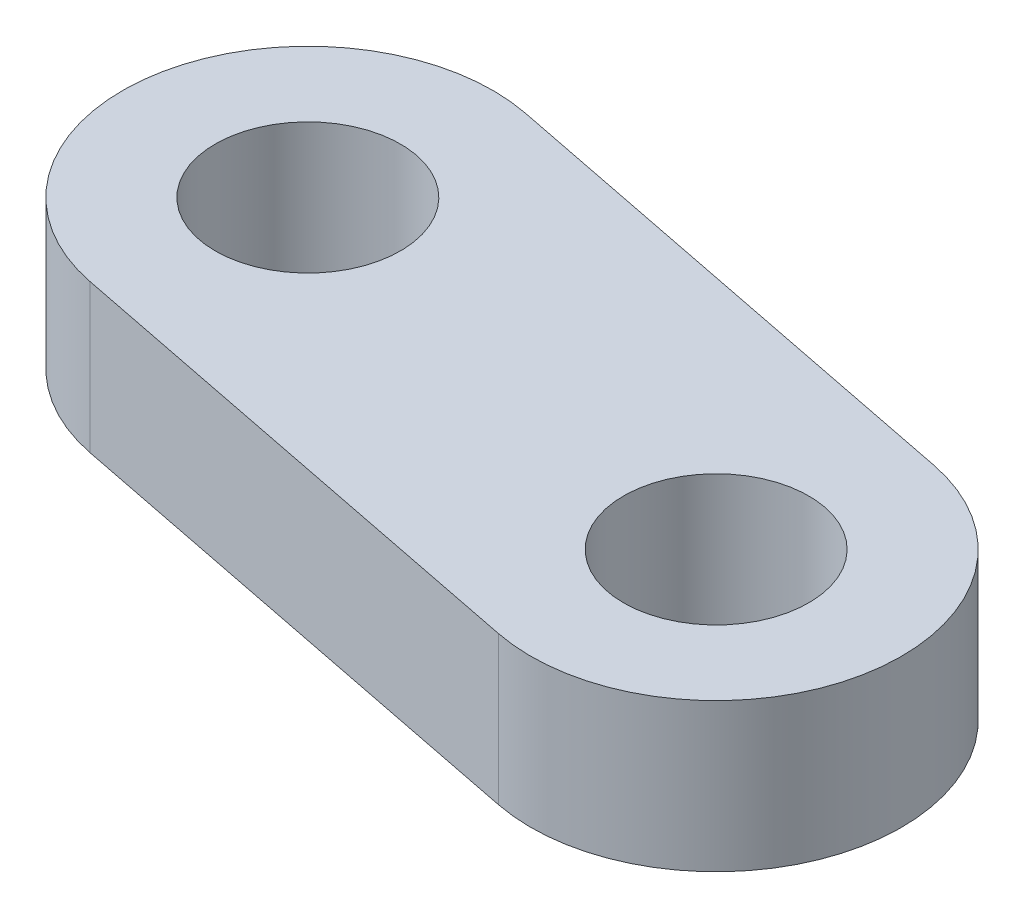
ISO-10303-21;
HEADER;
FILE_DESCRIPTION(('STEP AP214'),'2;1');
FILE_NAME('part.step','',(''),(''),'','','');
FILE_SCHEMA(('AUTOMOTIVE_DESIGN { 1 0 10303 214 1 1 1 1 }'));
ENDSEC;
DATA;
#1=APPLICATION_CONTEXT('core data for automotive mechanical design processes');
#2=APPLICATION_PROTOCOL_DEFINITION('international standard','automotive_design',2000,#1);
#3=PRODUCT_CONTEXT('',#1,'mechanical');
#4=PRODUCT('Part','Part','',(#3));
#5=PRODUCT_RELATED_PRODUCT_CATEGORY('part','',(#4));
#6=PRODUCT_DEFINITION_FORMATION('','',#4);
#7=PRODUCT_DEFINITION_CONTEXT('part definition',#1,'design');
#8=PRODUCT_DEFINITION('design','',#6,#7);
#9=PRODUCT_DEFINITION_SHAPE('','',#8);
#10=(LENGTH_UNIT() NAMED_UNIT(*) SI_UNIT(.MILLI.,.METRE.));
#11=(NAMED_UNIT(*) PLANE_ANGLE_UNIT() SI_UNIT($,.RADIAN.));
#12=(NAMED_UNIT(*) SI_UNIT($,.STERADIAN.) SOLID_ANGLE_UNIT());
#13=UNCERTAINTY_MEASURE_WITH_UNIT(LENGTH_MEASURE(1.E-05),#10,'distance_accuracy_value','');
#14=(GEOMETRIC_REPRESENTATION_CONTEXT(3) GLOBAL_UNCERTAINTY_ASSIGNED_CONTEXT((#13)) GLOBAL_UNIT_ASSIGNED_CONTEXT((#10,
#11,#12)) REPRESENTATION_CONTEXT('',''));
#15=CARTESIAN_POINT('',(0.,0.,0.));
#16=DIRECTION('',(0.,0.,1.));
#17=DIRECTION('',(1.,0.,0.));
#18=AXIS2_PLACEMENT_3D('',#15,#16,#17);
#19=CARTESIAN_POINT('',(0.,20.,0.));
#20=DIRECTION('',(0.,1.,0.));
#21=DIRECTION('',(0.,0.,1.));
#22=AXIS2_PLACEMENT_3D('',#19,#20,#21);
#23=PLANE('',#22);
#24=CARTESIAN_POINT('',(0.,20.,0.));
#25=DIRECTION('',(0.,1.,0.));
#26=DIRECTION('',(0.,0.,1.));
#27=AXIS2_PLACEMENT_3D('',#24,#25,#26);
#28=CIRCLE('',#27,12.5);
#29=CARTESIAN_POINT('',(0.,20.,12.5));
#30=VERTEX_POINT('',#29);
#31=EDGE_CURVE('E100',#30,#30,#28,.T.);
#32=ORIENTED_EDGE('',*,*,#31,.F.);
#33=EDGE_LOOP('',(#32));
#34=FACE_BOUND('',#33,.T.);
#35=CARTESIAN_POINT('',(0.,20.,0.));
#36=DIRECTION('',(0.,1.,0.));
#37=DIRECTION('',(0.,0.,1.));
#38=AXIS2_PLACEMENT_3D('',#35,#36,#37);
#39=CIRCLE('',#38,25.);
#40=CARTESIAN_POINT('',(4.84830465384728,20.,-24.5253734320903));
#41=VERTEX_POINT('',#40);
#42=CARTESIAN_POINT('',(-4.84830465384728,20.,24.5253734320903));
#43=VERTEX_POINT('',#42);
#44=EDGE_CURVE('E85',#41,#43,#39,.T.);
#45=ORIENTED_EDGE('',*,*,#44,.T.);
#46=DIRECTION('',(0.981014937283614,0.,0.193932186153892));
#47=VECTOR('',#46,1.);
#48=CARTESIAN_POINT('',(-4.84830465384728,20.,24.5253734320903));
#49=LINE('',#48,#47);
#50=CARTESIAN_POINT('',(63.8227409560057,20.,38.1006264628627));
#51=VERTEX_POINT('',#50);
#52=EDGE_CURVE('E80',#43,#51,#49,.T.);
#53=ORIENTED_EDGE('',*,*,#52,.T.);
#54=CARTESIAN_POINT('',(68.671045609853,20.,13.5752530307724));
#55=DIRECTION('',(0.,1.,0.));
#56=DIRECTION('',(0.,0.,1.));
#57=AXIS2_PLACEMENT_3D('',#54,#55,#56);
#58=CIRCLE('',#57,25.);
#59=CARTESIAN_POINT('',(73.5193502637002,20.,-10.9501204013179));
#60=VERTEX_POINT('',#59);
#61=EDGE_CURVE('E83',#51,#60,#58,.T.);
#62=ORIENTED_EDGE('',*,*,#61,.T.);
#63=DIRECTION('',(-0.981014937283614,0.,-0.193932186153891));
#64=VECTOR('',#63,1.);
#65=CARTESIAN_POINT('',(4.84830465384728,20.,-24.5253734320903));
#66=LINE('',#65,#64);
#67=EDGE_CURVE('E50',#60,#41,#66,.T.);
#68=ORIENTED_EDGE('',*,*,#67,.T.);
#69=EDGE_LOOP('',(#45,#53,#62,#68));
#70=FACE_BOUND('',#69,.T.);
#71=CARTESIAN_POINT('',(68.671045609853,20.,13.5752530307724));
#72=DIRECTION('',(0.,1.,0.));
#73=DIRECTION('',(0.,0.,1.));
#74=AXIS2_PLACEMENT_3D('',#71,#72,#73);
#75=CIRCLE('',#74,12.5);
#76=CARTESIAN_POINT('',(68.671045609853,20.,26.0752530307724));
#77=VERTEX_POINT('',#76);
#78=EDGE_CURVE('E115',#77,#77,#75,.T.);
#79=ORIENTED_EDGE('',*,*,#78,.F.);
#80=EDGE_LOOP('',(#79));
#81=FACE_BOUND('',#80,.T.);
#82=ADVANCED_FACE('F33',(#34,#70,#81),#23,.T.);
#83=CARTESIAN_POINT('',(0.,0.,0.));
#84=DIRECTION('',(0.,1.,0.));
#85=DIRECTION('',(0.,0.,1.));
#86=AXIS2_PLACEMENT_3D('',#83,#84,#85);
#87=PLANE('',#86);
#88=CARTESIAN_POINT('',(0.,0.,0.));
#89=DIRECTION('',(0.,1.,0.));
#90=DIRECTION('',(0.,0.,1.));
#91=AXIS2_PLACEMENT_3D('',#88,#89,#90);
#92=CIRCLE('',#91,25.);
#93=CARTESIAN_POINT('',(4.84830465384728,0.,-24.5253734320903));
#94=VERTEX_POINT('',#93);
#95=CARTESIAN_POINT('',(-4.84830465384728,0.,24.5253734320903));
#96=VERTEX_POINT('',#95);
#97=EDGE_CURVE('E97',#94,#96,#92,.T.);
#98=ORIENTED_EDGE('',*,*,#97,.F.);
#99=DIRECTION('',(-0.981014937283614,0.,-0.193932186153891));
#100=VECTOR('',#99,1.);
#101=CARTESIAN_POINT('',(4.84830465384728,0.,-24.5253734320903));
#102=LINE('',#101,#100);
#103=CARTESIAN_POINT('',(73.5193502637002,0.,-10.9501204013179));
#104=VERTEX_POINT('',#103);
#105=EDGE_CURVE('E73',#104,#94,#102,.T.);
#106=ORIENTED_EDGE('',*,*,#105,.F.);
#107=CARTESIAN_POINT('',(68.671045609853,0.,13.5752530307724));
#108=DIRECTION('',(0.,1.,0.));
#109=DIRECTION('',(0.,0.,1.));
#110=AXIS2_PLACEMENT_3D('',#107,#108,#109);
#111=CIRCLE('',#110,25.);
#112=CARTESIAN_POINT('',(63.8227409560057,0.,38.1006264628627));
#113=VERTEX_POINT('',#112);
#114=EDGE_CURVE('E67',#113,#104,#111,.T.);
#115=ORIENTED_EDGE('',*,*,#114,.F.);
#116=DIRECTION('',(0.981014937283614,0.,0.193932186153892));
#117=VECTOR('',#116,1.);
#118=CARTESIAN_POINT('',(-4.84830465384728,0.,24.5253734320903));
#119=LINE('',#118,#117);
#120=EDGE_CURVE('E89',#96,#113,#119,.T.);
#121=ORIENTED_EDGE('',*,*,#120,.F.);
#122=EDGE_LOOP('',(#98,#106,#115,#121));
#123=FACE_BOUND('',#122,.T.);
#124=CARTESIAN_POINT('',(0.,0.,0.));
#125=DIRECTION('',(0.,1.,0.));
#126=DIRECTION('',(0.,0.,1.));
#127=AXIS2_PLACEMENT_3D('',#124,#125,#126);
#128=CIRCLE('',#127,12.5);
#129=CARTESIAN_POINT('',(0.,0.,12.5));
#130=VERTEX_POINT('',#129);
#131=EDGE_CURVE('E112',#130,#130,#128,.T.);
#132=ORIENTED_EDGE('',*,*,#131,.T.);
#133=EDGE_LOOP('',(#132));
#134=FACE_BOUND('',#133,.T.);
#135=CARTESIAN_POINT('',(68.671045609853,0.,13.5752530307724));
#136=DIRECTION('',(0.,1.,0.));
#137=DIRECTION('',(0.,0.,1.));
#138=AXIS2_PLACEMENT_3D('',#135,#136,#137);
#139=CIRCLE('',#138,12.5);
#140=CARTESIAN_POINT('',(68.671045609853,0.,26.0752530307724));
#141=VERTEX_POINT('',#140);
#142=EDGE_CURVE('E118',#141,#141,#139,.T.);
#143=ORIENTED_EDGE('',*,*,#142,.T.);
#144=EDGE_LOOP('',(#143));
#145=FACE_BOUND('',#144,.T.);
#146=ADVANCED_FACE('F108',(#123,#134,#145),#87,.F.);
#147=CARTESIAN_POINT('',(0.,20.,0.));
#148=DIRECTION('',(0.,-1.,0.));
#149=DIRECTION('',(0.,0.,-1.));
#150=AXIS2_PLACEMENT_3D('',#147,#148,#149);
#151=CYLINDRICAL_SURFACE('',#150,25.);
#152=ORIENTED_EDGE('',*,*,#97,.T.);
#153=DIRECTION('',(0.,-1.,0.));
#154=VECTOR('',#153,1.);
#155=CARTESIAN_POINT('',(-4.84830465384728,20.,24.5253734320903));
#156=LINE('',#155,#154);
#157=EDGE_CURVE('E11',#43,#96,#156,.T.);
#158=ORIENTED_EDGE('',*,*,#157,.F.);
#159=ORIENTED_EDGE('',*,*,#44,.F.);
#160=DIRECTION('',(0.,-1.,0.));
#161=VECTOR('',#160,1.);
#162=CARTESIAN_POINT('',(4.84830465384728,20.,-24.5253734320903));
#163=LINE('',#162,#161);
#164=EDGE_CURVE('E93',#41,#94,#163,.T.);
#165=ORIENTED_EDGE('',*,*,#164,.T.);
#166=EDGE_LOOP('',(#152,#158,#159,#165));
#167=FACE_BOUND('',#166,.T.);
#168=ADVANCED_FACE('F35',(#167),#151,.T.);
#169=CARTESIAN_POINT('',(-4.84830465384728,20.,24.5253734320903));
#170=DIRECTION('',(0.193932186153892,0.,-0.981014937283614));
#171=DIRECTION('',(-0.981014937283614,0.,-0.193932186153892));
#172=AXIS2_PLACEMENT_3D('',#169,#170,#171);
#173=PLANE('',#172);
#174=ORIENTED_EDGE('',*,*,#120,.T.);
#175=DIRECTION('',(0.,-1.,0.));
#176=VECTOR('',#175,1.);
#177=CARTESIAN_POINT('',(63.8227409560057,20.,38.1006264628627));
#178=LINE('',#177,#176);
#179=EDGE_CURVE('E42',#51,#113,#178,.T.);
#180=ORIENTED_EDGE('',*,*,#179,.F.);
#181=ORIENTED_EDGE('',*,*,#52,.F.);
#182=ORIENTED_EDGE('',*,*,#157,.T.);
#183=EDGE_LOOP('',(#174,#180,#181,#182));
#184=FACE_BOUND('',#183,.T.);
#185=ADVANCED_FACE('F88',(#184),#173,.F.);
#186=CARTESIAN_POINT('',(68.671045609853,20.,13.5752530307724));
#187=DIRECTION('',(0.,-1.,0.));
#188=DIRECTION('',(0.,0.,-1.));
#189=AXIS2_PLACEMENT_3D('',#186,#187,#188);
#190=CYLINDRICAL_SURFACE('',#189,25.);
#191=ORIENTED_EDGE('',*,*,#114,.T.);
#192=DIRECTION('',(0.,-1.,0.));
#193=VECTOR('',#192,1.);
#194=CARTESIAN_POINT('',(73.5193502637002,20.,-10.9501204013179));
#195=LINE('',#194,#193);
#196=EDGE_CURVE('E90',#60,#104,#195,.T.);
#197=ORIENTED_EDGE('',*,*,#196,.F.);
#198=ORIENTED_EDGE('',*,*,#61,.F.);
#199=ORIENTED_EDGE('',*,*,#179,.T.);
#200=EDGE_LOOP('',(#191,#197,#198,#199));
#201=FACE_BOUND('',#200,.T.);
#202=ADVANCED_FACE('F91',(#201),#190,.T.);
#203=CARTESIAN_POINT('',(4.84830465384728,20.,-24.5253734320903));
#204=DIRECTION('',(-0.193932186153891,0.,0.981014937283614));
#205=DIRECTION('',(0.981014937283614,0.,0.193932186153891));
#206=AXIS2_PLACEMENT_3D('',#203,#204,#205);
#207=PLANE('',#206);
#208=ORIENTED_EDGE('',*,*,#105,.T.);
#209=ORIENTED_EDGE('',*,*,#164,.F.);
#210=ORIENTED_EDGE('',*,*,#67,.F.);
#211=ORIENTED_EDGE('',*,*,#196,.T.);
#212=EDGE_LOOP('',(#208,#209,#210,#211));
#213=FACE_BOUND('',#212,.T.);
#214=ADVANCED_FACE('F105',(#213),#207,.F.);
#215=CARTESIAN_POINT('',(0.,20.,0.));
#216=DIRECTION('',(0.,-1.,0.));
#217=DIRECTION('',(0.,0.,-1.));
#218=AXIS2_PLACEMENT_3D('',#215,#216,#217);
#219=CYLINDRICAL_SURFACE('',#218,12.5);
#220=ORIENTED_EDGE('',*,*,#31,.T.);
#221=EDGE_LOOP('',(#220));
#222=FACE_BOUND('',#221,.T.);
#223=ORIENTED_EDGE('',*,*,#131,.F.);
#224=EDGE_LOOP('',(#223));
#225=FACE_BOUND('',#224,.T.);
#226=ADVANCED_FACE('F135',(#222,#225),#219,.F.);
#227=CARTESIAN_POINT('',(68.671045609853,20.,13.5752530307724));
#228=DIRECTION('',(0.,-1.,0.));
#229=DIRECTION('',(0.,0.,-1.));
#230=AXIS2_PLACEMENT_3D('',#227,#228,#229);
#231=CYLINDRICAL_SURFACE('',#230,12.5);
#232=ORIENTED_EDGE('',*,*,#78,.T.);
#233=EDGE_LOOP('',(#232));
#234=FACE_BOUND('',#233,.T.);
#235=ORIENTED_EDGE('',*,*,#142,.F.);
#236=EDGE_LOOP('',(#235));
#237=FACE_BOUND('',#236,.T.);
#238=ADVANCED_FACE('F124',(#234,#237),#231,.F.);
#239=CLOSED_SHELL('',(#82,#146,#168,#185,#202,#214,#226,#238));
#240=MANIFOLD_SOLID_BREP('B2',#239);
#241=ADVANCED_BREP_SHAPE_REPRESENTATION('',(#18,#240),#14);
#242=SHAPE_DEFINITION_REPRESENTATION(#9,#241);
ENDSEC;
END-ISO-10303-21;
